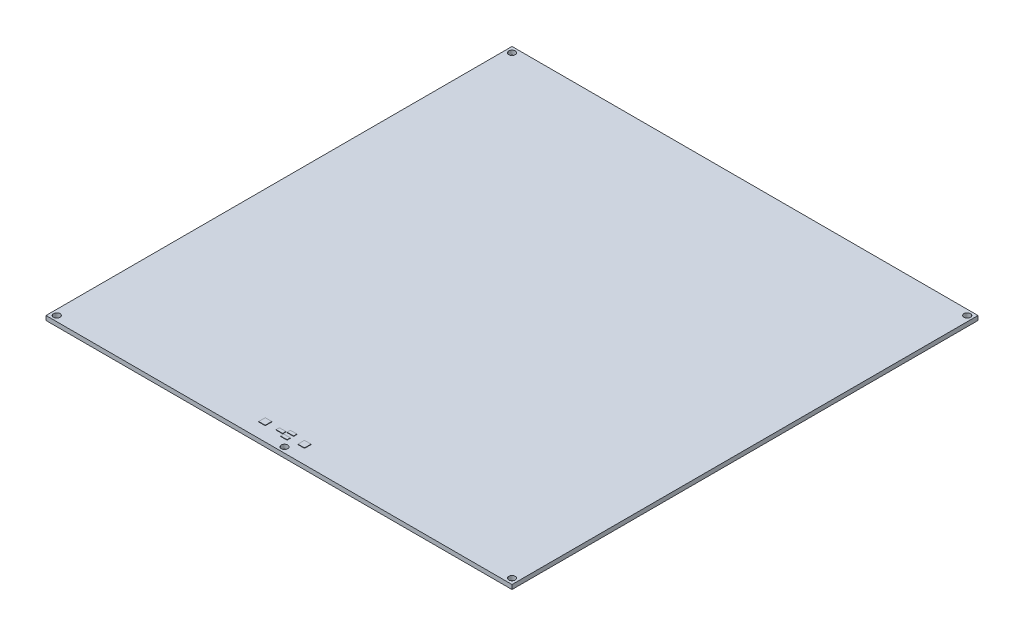
ISO-10303-21;
HEADER;
FILE_DESCRIPTION(('STEP AP214'),'2;1');
FILE_NAME('part.step','',(''),(''),'','','');
FILE_SCHEMA(('AUTOMOTIVE_DESIGN { 1 0 10303 214 1 1 1 1 }'));
ENDSEC;
DATA;
#1=APPLICATION_CONTEXT('core data for automotive mechanical design processes');
#2=APPLICATION_PROTOCOL_DEFINITION('international standard','automotive_design',2000,#1);
#3=PRODUCT_CONTEXT('',#1,'mechanical');
#4=PRODUCT('Part','Part','',(#3));
#5=PRODUCT_RELATED_PRODUCT_CATEGORY('part','',(#4));
#6=PRODUCT_DEFINITION_FORMATION('','',#4);
#7=PRODUCT_DEFINITION_CONTEXT('part definition',#1,'design');
#8=PRODUCT_DEFINITION('design','',#6,#7);
#9=PRODUCT_DEFINITION_SHAPE('','',#8);
#10=(LENGTH_UNIT() NAMED_UNIT(*) SI_UNIT(.MILLI.,.METRE.));
#11=(NAMED_UNIT(*) PLANE_ANGLE_UNIT() SI_UNIT($,.RADIAN.));
#12=(NAMED_UNIT(*) SI_UNIT($,.STERADIAN.) SOLID_ANGLE_UNIT());
#13=UNCERTAINTY_MEASURE_WITH_UNIT(LENGTH_MEASURE(1.E-05),#10,'distance_accuracy_value','');
#14=(GEOMETRIC_REPRESENTATION_CONTEXT(3) GLOBAL_UNCERTAINTY_ASSIGNED_CONTEXT((#13)) GLOBAL_UNIT_ASSIGNED_CONTEXT((#10,
#11,#12)) REPRESENTATION_CONTEXT('',''));
#15=CARTESIAN_POINT('',(0.,0.,0.));
#16=DIRECTION('',(0.,0.,1.));
#17=DIRECTION('',(1.,0.,0.));
#18=AXIS2_PLACEMENT_3D('',#15,#16,#17);
#19=CARTESIAN_POINT('',(0.,2.,0.));
#20=DIRECTION('',(0.,1.,0.));
#21=DIRECTION('',(0.,0.,1.));
#22=AXIS2_PLACEMENT_3D('',#19,#20,#21);
#23=PLANE('',#22);
#24=CARTESIAN_POINT('',(104.525132308728,2.,-104.525132308728));
#25=DIRECTION('',(0.,1.,0.));
#26=DIRECTION('',(0.,0.,1.));
#27=AXIS2_PLACEMENT_3D('',#24,#25,#26);
#28=CIRCLE('',#27,1.49999999999999);
#29=CARTESIAN_POINT('',(104.525132308728,2.,-103.025132308728));
#30=VERTEX_POINT('',#29);
#31=EDGE_CURVE('E521',#30,#30,#28,.T.);
#32=ORIENTED_EDGE('',*,*,#31,.F.);
#33=EDGE_LOOP('',(#32));
#34=FACE_BOUND('',#33,.T.);
#35=CARTESIAN_POINT('',(-104.525126265847,2.,104.525126265847));
#36=DIRECTION('',(0.,1.,0.));
#37=DIRECTION('',(0.,0.,1.));
#38=AXIS2_PLACEMENT_3D('',#35,#36,#37);
#39=CIRCLE('',#38,1.49999999999999);
#40=CARTESIAN_POINT('',(-104.525126265847,2.,106.025126265847));
#41=VERTEX_POINT('',#40);
#42=EDGE_CURVE('E523',#41,#41,#39,.T.);
#43=ORIENTED_EDGE('',*,*,#42,.F.);
#44=EDGE_LOOP('',(#43));
#45=FACE_BOUND('',#44,.T.);
#46=CARTESIAN_POINT('',(104.474867691272,2.,104.474867691272));
#47=DIRECTION('',(0.,1.,0.));
#48=DIRECTION('',(0.,0.,1.));
#49=AXIS2_PLACEMENT_3D('',#46,#47,#48);
#50=CIRCLE('',#49,1.49999999999999);
#51=CARTESIAN_POINT('',(104.474867691272,2.,105.974867691272));
#52=VERTEX_POINT('',#51);
#53=EDGE_CURVE('E531',#52,#52,#50,.T.);
#54=ORIENTED_EDGE('',*,*,#53,.F.);
#55=EDGE_LOOP('',(#54));
#56=FACE_BOUND('',#55,.T.);
#57=CARTESIAN_POINT('',(-104.474867691272,2.,-104.474867691272));
#58=DIRECTION('',(0.,1.,0.));
#59=DIRECTION('',(0.,0.,1.));
#60=AXIS2_PLACEMENT_3D('',#57,#58,#59);
#61=CIRCLE('',#60,1.49999999999999);
#62=CARTESIAN_POINT('',(-104.474867691272,2.,-102.974867691272));
#63=VERTEX_POINT('',#62);
#64=EDGE_CURVE('E537',#63,#63,#61,.T.);
#65=ORIENTED_EDGE('',*,*,#64,.F.);
#66=EDGE_LOOP('',(#65));
#67=FACE_BOUND('',#66,.T.);
#68=CARTESIAN_POINT('',(0.,2.,104.474867691272));
#69=DIRECTION('',(0.,1.,0.));
#70=DIRECTION('',(0.,0.,1.));
#71=AXIS2_PLACEMENT_3D('',#68,#69,#70);
#72=CIRCLE('',#71,1.49999999999999);
#73=CARTESIAN_POINT('',(0.,2.,105.974867691272));
#74=VERTEX_POINT('',#73);
#75=EDGE_CURVE('E543',#74,#74,#72,.T.);
#76=ORIENTED_EDGE('',*,*,#75,.F.);
#77=EDGE_LOOP('',(#76));
#78=FACE_BOUND('',#77,.T.);
#79=DIRECTION('',(-1.,0.,0.));
#80=VECTOR('',#79,1.);
#81=CARTESIAN_POINT('',(-5.04999999999998,2.,96.75));
#82=LINE('',#81,#80);
#83=CARTESIAN_POINT('',(-2.04999999999998,2.,96.75));
#84=VERTEX_POINT('',#83);
#85=CARTESIAN_POINT('',(-5.04999999999998,2.,96.75));
#86=VERTEX_POINT('',#85);
#87=EDGE_CURVE('E225',#84,#86,#82,.T.);
#88=ORIENTED_EDGE('',*,*,#87,.F.);
#89=DIRECTION('',(0.,0.,-1.));
#90=VECTOR('',#89,1.);
#91=CARTESIAN_POINT('',(-2.04999999999998,2.,96.75));
#92=LINE('',#91,#90);
#93=CARTESIAN_POINT('',(-2.04999999999998,2.,98.25));
#94=VERTEX_POINT('',#93);
#95=EDGE_CURVE('E222',#94,#84,#92,.T.);
#96=ORIENTED_EDGE('',*,*,#95,.F.);
#97=DIRECTION('',(1.,0.,0.));
#98=VECTOR('',#97,1.);
#99=CARTESIAN_POINT('',(-2.04999999999998,2.,98.25));
#100=LINE('',#99,#98);
#101=CARTESIAN_POINT('',(-5.04999999999998,2.,98.25));
#102=VERTEX_POINT('',#101);
#103=EDGE_CURVE('E234',#102,#94,#100,.T.);
#104=ORIENTED_EDGE('',*,*,#103,.F.);
#105=DIRECTION('',(0.,0.,1.));
#106=VECTOR('',#105,1.);
#107=CARTESIAN_POINT('',(-5.04999999999998,2.,98.25));
#108=LINE('',#107,#106);
#109=EDGE_CURVE('E242',#86,#102,#108,.T.);
#110=ORIENTED_EDGE('',*,*,#109,.F.);
#111=EDGE_LOOP('',(#88,#96,#104,#110));
#112=FACE_BOUND('',#111,.T.);
#113=DIRECTION('',(1.,0.,0.));
#114=VECTOR('',#113,1.);
#115=CARTESIAN_POINT('',(-12.8,2.,100.5));
#116=LINE('',#115,#114);
#117=CARTESIAN_POINT('',(-15.8,2.,100.5));
#118=VERTEX_POINT('',#117);
#119=CARTESIAN_POINT('',(-12.8,2.,100.5));
#120=VERTEX_POINT('',#119);
#121=EDGE_CURVE('E296',#118,#120,#116,.T.);
#122=ORIENTED_EDGE('',*,*,#121,.F.);
#123=DIRECTION('',(0.,0.,1.));
#124=VECTOR('',#123,1.);
#125=CARTESIAN_POINT('',(-15.8,2.,100.5));
#126=LINE('',#125,#124);
#127=CARTESIAN_POINT('',(-15.8,2.,97.5));
#128=VERTEX_POINT('',#127);
#129=EDGE_CURVE('E282',#128,#118,#126,.T.);
#130=ORIENTED_EDGE('',*,*,#129,.F.);
#131=DIRECTION('',(-1.,0.,0.));
#132=VECTOR('',#131,1.);
#133=CARTESIAN_POINT('',(-15.8,2.,97.5));
#134=LINE('',#133,#132);
#135=CARTESIAN_POINT('',(-12.8,2.,97.5));
#136=VERTEX_POINT('',#135);
#137=EDGE_CURVE('E287',#136,#128,#134,.T.);
#138=ORIENTED_EDGE('',*,*,#137,.F.);
#139=DIRECTION('',(0.,0.,-1.));
#140=VECTOR('',#139,1.);
#141=CARTESIAN_POINT('',(-12.8,2.,97.5));
#142=LINE('',#141,#140);
#143=EDGE_CURVE('E298',#120,#136,#142,.T.);
#144=ORIENTED_EDGE('',*,*,#143,.F.);
#145=EDGE_LOOP('',(#122,#130,#138,#144));
#146=FACE_BOUND('',#145,.T.);
#147=DIRECTION('',(-1.,0.,0.));
#148=VECTOR('',#147,1.);
#149=CARTESIAN_POINT('',(107.,2.,-107.));
#150=LINE('',#149,#148);
#151=CARTESIAN_POINT('',(107.,2.,-107.));
#152=VERTEX_POINT('',#151);
#153=CARTESIAN_POINT('',(-107.,2.,-107.));
#154=VERTEX_POINT('',#153);
#155=EDGE_CURVE('E340',#152,#154,#150,.T.);
#156=ORIENTED_EDGE('',*,*,#155,.T.);
#157=DIRECTION('',(0.,0.,1.));
#158=VECTOR('',#157,1.);
#159=CARTESIAN_POINT('',(-107.,2.,-107.));
#160=LINE('',#159,#158);
#161=CARTESIAN_POINT('',(-107.,2.,107.));
#162=VERTEX_POINT('',#161);
#163=EDGE_CURVE('E356',#154,#162,#160,.T.);
#164=ORIENTED_EDGE('',*,*,#163,.T.);
#165=DIRECTION('',(1.,0.,0.));
#166=VECTOR('',#165,1.);
#167=CARTESIAN_POINT('',(-107.,2.,107.));
#168=LINE('',#167,#166);
#169=CARTESIAN_POINT('',(107.,2.,107.));
#170=VERTEX_POINT('',#169);
#171=EDGE_CURVE('E359',#162,#170,#168,.T.);
#172=ORIENTED_EDGE('',*,*,#171,.T.);
#173=DIRECTION('',(0.,0.,-1.));
#174=VECTOR('',#173,1.);
#175=CARTESIAN_POINT('',(107.,2.,107.));
#176=LINE('',#175,#174);
#177=EDGE_CURVE('E345',#170,#152,#176,.T.);
#178=ORIENTED_EDGE('',*,*,#177,.T.);
#179=EDGE_LOOP('',(#156,#164,#172,#178));
#180=FACE_BOUND('',#179,.T.);
#181=DIRECTION('',(1.,0.,0.));
#182=VECTOR('',#181,1.);
#183=CARTESIAN_POINT('',(5.20000000000002,2.,100.5));
#184=LINE('',#183,#182);
#185=CARTESIAN_POINT('',(2.20000000000002,2.,100.5));
#186=VERTEX_POINT('',#185);
#187=CARTESIAN_POINT('',(5.20000000000002,2.,100.5));
#188=VERTEX_POINT('',#187);
#189=EDGE_CURVE('E325',#186,#188,#184,.T.);
#190=ORIENTED_EDGE('',*,*,#189,.F.);
#191=DIRECTION('',(0.,0.,1.));
#192=VECTOR('',#191,1.);
#193=CARTESIAN_POINT('',(2.20000000000002,2.,100.5));
#194=LINE('',#193,#192);
#195=CARTESIAN_POINT('',(2.20000000000002,2.,97.5));
#196=VERTEX_POINT('',#195);
#197=EDGE_CURVE('E311',#196,#186,#194,.T.);
#198=ORIENTED_EDGE('',*,*,#197,.F.);
#199=DIRECTION('',(-1.,0.,0.));
#200=VECTOR('',#199,1.);
#201=CARTESIAN_POINT('',(2.20000000000002,2.,97.5));
#202=LINE('',#201,#200);
#203=CARTESIAN_POINT('',(5.20000000000002,2.,97.5));
#204=VERTEX_POINT('',#203);
#205=EDGE_CURVE('E316',#204,#196,#202,.T.);
#206=ORIENTED_EDGE('',*,*,#205,.F.);
#207=DIRECTION('',(0.,0.,-1.));
#208=VECTOR('',#207,1.);
#209=CARTESIAN_POINT('',(5.20000000000002,2.,97.5));
#210=LINE('',#209,#208);
#211=EDGE_CURVE('E327',#188,#204,#210,.T.);
#212=ORIENTED_EDGE('',*,*,#211,.F.);
#213=EDGE_LOOP('',(#190,#198,#206,#212));
#214=FACE_BOUND('',#213,.T.);
#215=DIRECTION('',(0.,0.,1.));
#216=VECTOR('',#215,1.);
#217=CARTESIAN_POINT('',(-8.54999999999998,2.,99.75));
#218=LINE('',#217,#216);
#219=CARTESIAN_POINT('',(-8.54999999999998,2.,98.25));
#220=VERTEX_POINT('',#219);
#221=CARTESIAN_POINT('',(-8.54999999999998,2.,99.75));
#222=VERTEX_POINT('',#221);
#223=EDGE_CURVE('E267',#220,#222,#218,.T.);
#224=ORIENTED_EDGE('',*,*,#223,.F.);
#225=DIRECTION('',(-1.,0.,0.));
#226=VECTOR('',#225,1.);
#227=CARTESIAN_POINT('',(-8.54999999999998,2.,98.25));
#228=LINE('',#227,#226);
#229=CARTESIAN_POINT('',(-5.54999999999998,2.,98.25));
#230=VERTEX_POINT('',#229);
#231=EDGE_CURVE('E253',#230,#220,#228,.T.);
#232=ORIENTED_EDGE('',*,*,#231,.F.);
#233=DIRECTION('',(0.,0.,-1.));
#234=VECTOR('',#233,1.);
#235=CARTESIAN_POINT('',(-5.54999999999998,2.,98.25));
#236=LINE('',#235,#234);
#237=CARTESIAN_POINT('',(-5.54999999999998,2.,99.75));
#238=VERTEX_POINT('',#237);
#239=EDGE_CURVE('E258',#238,#230,#236,.T.);
#240=ORIENTED_EDGE('',*,*,#239,.F.);
#241=DIRECTION('',(1.,0.,0.));
#242=VECTOR('',#241,1.);
#243=CARTESIAN_POINT('',(-5.54999999999998,2.,99.75));
#244=LINE('',#243,#242);
#245=EDGE_CURVE('E269',#222,#238,#244,.T.);
#246=ORIENTED_EDGE('',*,*,#245,.F.);
#247=EDGE_LOOP('',(#224,#232,#240,#246));
#248=FACE_BOUND('',#247,.T.);
#249=DIRECTION('',(-1.,0.,0.));
#250=VECTOR('',#249,1.);
#251=CARTESIAN_POINT('',(-5.04999999999998,2.,99.75));
#252=LINE('',#251,#250);
#253=CARTESIAN_POINT('',(-2.04999999999998,2.,99.75));
#254=VERTEX_POINT('',#253);
#255=CARTESIAN_POINT('',(-5.04999999999998,2.,99.75));
#256=VERTEX_POINT('',#255);
#257=EDGE_CURVE('E553',#254,#256,#252,.T.);
#258=ORIENTED_EDGE('',*,*,#257,.F.);
#259=DIRECTION('',(0.,0.,-1.));
#260=VECTOR('',#259,1.);
#261=CARTESIAN_POINT('',(-2.04999999999998,2.,99.75));
#262=LINE('',#261,#260);
#263=CARTESIAN_POINT('',(-2.04999999999998,2.,101.25));
#264=VERTEX_POINT('',#263);
#265=EDGE_CURVE('E220',#264,#254,#262,.T.);
#266=ORIENTED_EDGE('',*,*,#265,.F.);
#267=DIRECTION('',(1.,0.,0.));
#268=VECTOR('',#267,1.);
#269=CARTESIAN_POINT('',(-2.04999999999998,2.,101.25));
#270=LINE('',#269,#268);
#271=CARTESIAN_POINT('',(-5.04999999999998,2.,101.25));
#272=VERTEX_POINT('',#271);
#273=EDGE_CURVE('E216',#272,#264,#270,.T.);
#274=ORIENTED_EDGE('',*,*,#273,.F.);
#275=DIRECTION('',(0.,0.,1.));
#276=VECTOR('',#275,1.);
#277=CARTESIAN_POINT('',(-5.04999999999998,2.,101.25));
#278=LINE('',#277,#276);
#279=EDGE_CURVE('E555',#256,#272,#278,.T.);
#280=ORIENTED_EDGE('',*,*,#279,.F.);
#281=EDGE_LOOP('',(#258,#266,#274,#280));
#282=FACE_BOUND('',#281,.T.);
#283=ADVANCED_FACE('F34',(#34,#45,#56,#67,#78,#112,#146,#180,#214,#248,#282),#23,.T.);
#284=CARTESIAN_POINT('',(107.,0.,-107.));
#285=DIRECTION('',(0.,0.,-1.));
#286=DIRECTION('',(-1.,0.,0.));
#287=AXIS2_PLACEMENT_3D('',#284,#285,#286);
#288=PLANE('',#287);
#289=ORIENTED_EDGE('',*,*,#155,.F.);
#290=DIRECTION('',(0.,1.,0.));
#291=VECTOR('',#290,1.);
#292=CARTESIAN_POINT('',(107.,0.,-107.));
#293=LINE('',#292,#291);
#294=CARTESIAN_POINT('',(107.,0.,-107.));
#295=VERTEX_POINT('',#294);
#296=EDGE_CURVE('E11',#295,#152,#293,.T.);
#297=ORIENTED_EDGE('',*,*,#296,.F.);
#298=DIRECTION('',(-1.,0.,0.));
#299=VECTOR('',#298,1.);
#300=CARTESIAN_POINT('',(107.,0.,-107.));
#301=LINE('',#300,#299);
#302=CARTESIAN_POINT('',(-107.,0.,-107.));
#303=VERTEX_POINT('',#302);
#304=EDGE_CURVE('E341',#295,#303,#301,.T.);
#305=ORIENTED_EDGE('',*,*,#304,.T.);
#306=DIRECTION('',(0.,1.,0.));
#307=VECTOR('',#306,1.);
#308=CARTESIAN_POINT('',(-107.,0.,-107.));
#309=LINE('',#308,#307);
#310=EDGE_CURVE('E38',#303,#154,#309,.T.);
#311=ORIENTED_EDGE('',*,*,#310,.T.);
#312=EDGE_LOOP('',(#289,#297,#305,#311));
#313=FACE_BOUND('',#312,.T.);
#314=ADVANCED_FACE('F36',(#313),#288,.T.);
#315=CARTESIAN_POINT('',(107.,0.,107.));
#316=DIRECTION('',(1.,0.,0.));
#317=DIRECTION('',(0.,0.,-1.));
#318=AXIS2_PLACEMENT_3D('',#315,#316,#317);
#319=PLANE('',#318);
#320=ORIENTED_EDGE('',*,*,#177,.F.);
#321=DIRECTION('',(0.,1.,0.));
#322=VECTOR('',#321,1.);
#323=CARTESIAN_POINT('',(107.,0.,107.));
#324=LINE('',#323,#322);
#325=CARTESIAN_POINT('',(107.,0.,107.));
#326=VERTEX_POINT('',#325);
#327=EDGE_CURVE('E43',#326,#170,#324,.T.);
#328=ORIENTED_EDGE('',*,*,#327,.F.);
#329=DIRECTION('',(0.,0.,-1.));
#330=VECTOR('',#329,1.);
#331=CARTESIAN_POINT('',(107.,0.,107.));
#332=LINE('',#331,#330);
#333=EDGE_CURVE('E351',#326,#295,#332,.T.);
#334=ORIENTED_EDGE('',*,*,#333,.T.);
#335=ORIENTED_EDGE('',*,*,#296,.T.);
#336=EDGE_LOOP('',(#320,#328,#334,#335));
#337=FACE_BOUND('',#336,.T.);
#338=ADVANCED_FACE('F377',(#337),#319,.T.);
#339=CARTESIAN_POINT('',(-107.,0.,107.));
#340=DIRECTION('',(0.,0.,1.));
#341=DIRECTION('',(1.,0.,0.));
#342=AXIS2_PLACEMENT_3D('',#339,#340,#341);
#343=PLANE('',#342);
#344=ORIENTED_EDGE('',*,*,#171,.F.);
#345=DIRECTION('',(0.,1.,0.));
#346=VECTOR('',#345,1.);
#347=CARTESIAN_POINT('',(-107.,0.,107.));
#348=LINE('',#347,#346);
#349=CARTESIAN_POINT('',(-107.,0.,107.));
#350=VERTEX_POINT('',#349);
#351=EDGE_CURVE('E364',#350,#162,#348,.T.);
#352=ORIENTED_EDGE('',*,*,#351,.F.);
#353=DIRECTION('',(1.,0.,0.));
#354=VECTOR('',#353,1.);
#355=CARTESIAN_POINT('',(-107.,0.,107.));
#356=LINE('',#355,#354);
#357=EDGE_CURVE('E348',#350,#326,#356,.T.);
#358=ORIENTED_EDGE('',*,*,#357,.T.);
#359=ORIENTED_EDGE('',*,*,#327,.T.);
#360=EDGE_LOOP('',(#344,#352,#358,#359));
#361=FACE_BOUND('',#360,.T.);
#362=ADVANCED_FACE('F383',(#361),#343,.T.);
#363=CARTESIAN_POINT('',(-107.,0.,-107.));
#364=DIRECTION('',(-1.,0.,0.));
#365=DIRECTION('',(0.,0.,1.));
#366=AXIS2_PLACEMENT_3D('',#363,#364,#365);
#367=PLANE('',#366);
#368=ORIENTED_EDGE('',*,*,#163,.F.);
#369=ORIENTED_EDGE('',*,*,#310,.F.);
#370=DIRECTION('',(0.,0.,1.));
#371=VECTOR('',#370,1.);
#372=CARTESIAN_POINT('',(-107.,0.,-107.));
#373=LINE('',#372,#371);
#374=EDGE_CURVE('E344',#303,#350,#373,.T.);
#375=ORIENTED_EDGE('',*,*,#374,.T.);
#376=ORIENTED_EDGE('',*,*,#351,.T.);
#377=EDGE_LOOP('',(#368,#369,#375,#376));
#378=FACE_BOUND('',#377,.T.);
#379=ADVANCED_FACE('F372',(#378),#367,.T.);
#380=CARTESIAN_POINT('',(0.,0.,0.));
#381=DIRECTION('',(0.,1.,0.));
#382=DIRECTION('',(0.,0.,1.));
#383=AXIS2_PLACEMENT_3D('',#380,#381,#382);
#384=PLANE('',#383);
#385=CARTESIAN_POINT('',(104.525132308728,0.,-104.525132308728));
#386=DIRECTION('',(0.,1.,0.));
#387=DIRECTION('',(0.,0.,1.));
#388=AXIS2_PLACEMENT_3D('',#385,#386,#387);
#389=CIRCLE('',#388,1.49999999999999);
#390=CARTESIAN_POINT('',(104.525132308728,0.,-103.025132308728));
#391=VERTEX_POINT('',#390);
#392=EDGE_CURVE('E519',#391,#391,#389,.T.);
#393=ORIENTED_EDGE('',*,*,#392,.T.);
#394=EDGE_LOOP('',(#393));
#395=FACE_BOUND('',#394,.T.);
#396=CARTESIAN_POINT('',(-104.525126265847,0.,104.525126265847));
#397=DIRECTION('',(0.,1.,0.));
#398=DIRECTION('',(0.,0.,1.));
#399=AXIS2_PLACEMENT_3D('',#396,#397,#398);
#400=CIRCLE('',#399,1.49999999999999);
#401=CARTESIAN_POINT('',(-104.525126265847,0.,106.025126265847));
#402=VERTEX_POINT('',#401);
#403=EDGE_CURVE('E528',#402,#402,#400,.T.);
#404=ORIENTED_EDGE('',*,*,#403,.T.);
#405=EDGE_LOOP('',(#404));
#406=FACE_BOUND('',#405,.T.);
#407=CARTESIAN_POINT('',(104.474867691272,0.,104.474867691272));
#408=DIRECTION('',(0.,1.,0.));
#409=DIRECTION('',(0.,0.,1.));
#410=AXIS2_PLACEMENT_3D('',#407,#408,#409);
#411=CIRCLE('',#410,1.49999999999999);
#412=CARTESIAN_POINT('',(104.474867691272,0.,105.974867691272));
#413=VERTEX_POINT('',#412);
#414=EDGE_CURVE('E534',#413,#413,#411,.T.);
#415=ORIENTED_EDGE('',*,*,#414,.T.);
#416=EDGE_LOOP('',(#415));
#417=FACE_BOUND('',#416,.T.);
#418=CARTESIAN_POINT('',(-104.474867691272,0.,-104.474867691272));
#419=DIRECTION('',(0.,1.,0.));
#420=DIRECTION('',(0.,0.,1.));
#421=AXIS2_PLACEMENT_3D('',#418,#419,#420);
#422=CIRCLE('',#421,1.49999999999999);
#423=CARTESIAN_POINT('',(-104.474867691272,0.,-102.974867691272));
#424=VERTEX_POINT('',#423);
#425=EDGE_CURVE('E540',#424,#424,#422,.T.);
#426=ORIENTED_EDGE('',*,*,#425,.T.);
#427=EDGE_LOOP('',(#426));
#428=FACE_BOUND('',#427,.T.);
#429=CARTESIAN_POINT('',(0.,0.,104.474867691272));
#430=DIRECTION('',(0.,1.,0.));
#431=DIRECTION('',(0.,0.,1.));
#432=AXIS2_PLACEMENT_3D('',#429,#430,#431);
#433=CIRCLE('',#432,1.49999999999999);
#434=CARTESIAN_POINT('',(0.,0.,105.974867691272));
#435=VERTEX_POINT('',#434);
#436=EDGE_CURVE('E546',#435,#435,#433,.T.);
#437=ORIENTED_EDGE('',*,*,#436,.T.);
#438=EDGE_LOOP('',(#437));
#439=FACE_BOUND('',#438,.T.);
#440=ORIENTED_EDGE('',*,*,#304,.F.);
#441=ORIENTED_EDGE('',*,*,#333,.F.);
#442=ORIENTED_EDGE('',*,*,#357,.F.);
#443=ORIENTED_EDGE('',*,*,#374,.F.);
#444=EDGE_LOOP('',(#440,#441,#442,#443));
#445=FACE_BOUND('',#444,.T.);
#446=ADVANCED_FACE('F380',(#395,#406,#417,#428,#439,#445),#384,.F.);
#447=CARTESIAN_POINT('',(2.20000000000002,2.2,100.5));
#448=DIRECTION('',(1.,0.,0.));
#449=DIRECTION('',(0.,0.,-1.));
#450=AXIS2_PLACEMENT_3D('',#447,#448,#449);
#451=PLANE('',#450);
#452=ORIENTED_EDGE('',*,*,#197,.T.);
#453=DIRECTION('',(0.,-1.,0.));
#454=VECTOR('',#453,1.);
#455=CARTESIAN_POINT('',(2.20000000000002,2.2,100.5));
#456=LINE('',#455,#454);
#457=CARTESIAN_POINT('',(2.20000000000002,2.2,100.5));
#458=VERTEX_POINT('',#457);
#459=EDGE_CURVE('E338',#458,#186,#456,.T.);
#460=ORIENTED_EDGE('',*,*,#459,.F.);
#461=DIRECTION('',(0.,0.,1.));
#462=VECTOR('',#461,1.);
#463=CARTESIAN_POINT('',(2.20000000000002,2.2,100.5));
#464=LINE('',#463,#462);
#465=CARTESIAN_POINT('',(2.20000000000002,2.2,97.5));
#466=VERTEX_POINT('',#465);
#467=EDGE_CURVE('E312',#466,#458,#464,.T.);
#468=ORIENTED_EDGE('',*,*,#467,.F.);
#469=DIRECTION('',(0.,-1.,0.));
#470=VECTOR('',#469,1.);
#471=CARTESIAN_POINT('',(2.20000000000002,2.2,97.5));
#472=LINE('',#471,#470);
#473=EDGE_CURVE('E322',#466,#196,#472,.T.);
#474=ORIENTED_EDGE('',*,*,#473,.T.);
#475=EDGE_LOOP('',(#452,#460,#468,#474));
#476=FACE_BOUND('',#475,.T.);
#477=ADVANCED_FACE('F402',(#476),#451,.F.);
#478=CARTESIAN_POINT('',(5.20000000000002,2.2,100.5));
#479=DIRECTION('',(0.,0.,-1.));
#480=DIRECTION('',(-1.,0.,0.));
#481=AXIS2_PLACEMENT_3D('',#478,#479,#480);
#482=PLANE('',#481);
#483=ORIENTED_EDGE('',*,*,#189,.T.);
#484=DIRECTION('',(0.,-1.,0.));
#485=VECTOR('',#484,1.);
#486=CARTESIAN_POINT('',(5.20000000000002,2.2,100.5));
#487=LINE('',#486,#485);
#488=CARTESIAN_POINT('',(5.20000000000002,2.2,100.5));
#489=VERTEX_POINT('',#488);
#490=EDGE_CURVE('E335',#489,#188,#487,.T.);
#491=ORIENTED_EDGE('',*,*,#490,.F.);
#492=DIRECTION('',(1.,0.,0.));
#493=VECTOR('',#492,1.);
#494=CARTESIAN_POINT('',(5.20000000000002,2.2,100.5));
#495=LINE('',#494,#493);
#496=EDGE_CURVE('E315',#458,#489,#495,.T.);
#497=ORIENTED_EDGE('',*,*,#496,.F.);
#498=ORIENTED_EDGE('',*,*,#459,.T.);
#499=EDGE_LOOP('',(#483,#491,#497,#498));
#500=FACE_BOUND('',#499,.T.);
#501=ADVANCED_FACE('F406',(#500),#482,.F.);
#502=CARTESIAN_POINT('',(5.20000000000002,2.2,97.5));
#503=DIRECTION('',(-1.,0.,0.));
#504=DIRECTION('',(0.,0.,1.));
#505=AXIS2_PLACEMENT_3D('',#502,#503,#504);
#506=PLANE('',#505);
#507=ORIENTED_EDGE('',*,*,#211,.T.);
#508=DIRECTION('',(0.,-1.,0.));
#509=VECTOR('',#508,1.);
#510=CARTESIAN_POINT('',(5.20000000000002,2.2,97.5));
#511=LINE('',#510,#509);
#512=CARTESIAN_POINT('',(5.20000000000002,2.2,97.5));
#513=VERTEX_POINT('',#512);
#514=EDGE_CURVE('E333',#513,#204,#511,.T.);
#515=ORIENTED_EDGE('',*,*,#514,.F.);
#516=DIRECTION('',(0.,0.,-1.));
#517=VECTOR('',#516,1.);
#518=CARTESIAN_POINT('',(5.20000000000002,2.2,97.5));
#519=LINE('',#518,#517);
#520=EDGE_CURVE('E318',#489,#513,#519,.T.);
#521=ORIENTED_EDGE('',*,*,#520,.F.);
#522=ORIENTED_EDGE('',*,*,#490,.T.);
#523=EDGE_LOOP('',(#507,#515,#521,#522));
#524=FACE_BOUND('',#523,.T.);
#525=ADVANCED_FACE('F410',(#524),#506,.F.);
#526=CARTESIAN_POINT('',(2.20000000000002,2.2,97.5));
#527=DIRECTION('',(0.,0.,1.));
#528=DIRECTION('',(1.,0.,0.));
#529=AXIS2_PLACEMENT_3D('',#526,#527,#528);
#530=PLANE('',#529);
#531=ORIENTED_EDGE('',*,*,#205,.T.);
#532=ORIENTED_EDGE('',*,*,#473,.F.);
#533=DIRECTION('',(-1.,0.,0.));
#534=VECTOR('',#533,1.);
#535=CARTESIAN_POINT('',(2.20000000000002,2.2,97.5));
#536=LINE('',#535,#534);
#537=EDGE_CURVE('E320',#513,#466,#536,.T.);
#538=ORIENTED_EDGE('',*,*,#537,.F.);
#539=ORIENTED_EDGE('',*,*,#514,.T.);
#540=EDGE_LOOP('',(#531,#532,#538,#539));
#541=FACE_BOUND('',#540,.T.);
#542=ADVANCED_FACE('F414',(#541),#530,.F.);
#543=CARTESIAN_POINT('',(0.,2.2,0.));
#544=DIRECTION('',(0.,-1.,0.));
#545=DIRECTION('',(0.,0.,-1.));
#546=AXIS2_PLACEMENT_3D('',#543,#544,#545);
#547=PLANE('',#546);
#548=ORIENTED_EDGE('',*,*,#467,.T.);
#549=ORIENTED_EDGE('',*,*,#496,.T.);
#550=ORIENTED_EDGE('',*,*,#520,.T.);
#551=ORIENTED_EDGE('',*,*,#537,.T.);
#552=EDGE_LOOP('',(#548,#549,#550,#551));
#553=FACE_BOUND('',#552,.T.);
#554=ADVANCED_FACE('F418',(#553),#547,.F.);
#555=CARTESIAN_POINT('',(-15.8,2.2,100.5));
#556=DIRECTION('',(1.,0.,0.));
#557=DIRECTION('',(0.,0.,-1.));
#558=AXIS2_PLACEMENT_3D('',#555,#556,#557);
#559=PLANE('',#558);
#560=ORIENTED_EDGE('',*,*,#129,.T.);
#561=DIRECTION('',(0.,-1.,0.));
#562=VECTOR('',#561,1.);
#563=CARTESIAN_POINT('',(-15.8,2.2,100.5));
#564=LINE('',#563,#562);
#565=CARTESIAN_POINT('',(-15.8,2.2,100.5));
#566=VERTEX_POINT('',#565);
#567=EDGE_CURVE('E309',#566,#118,#564,.T.);
#568=ORIENTED_EDGE('',*,*,#567,.F.);
#569=DIRECTION('',(0.,0.,1.));
#570=VECTOR('',#569,1.);
#571=CARTESIAN_POINT('',(-15.8,2.2,100.5));
#572=LINE('',#571,#570);
#573=CARTESIAN_POINT('',(-15.8,2.2,97.5));
#574=VERTEX_POINT('',#573);
#575=EDGE_CURVE('E283',#574,#566,#572,.T.);
#576=ORIENTED_EDGE('',*,*,#575,.F.);
#577=DIRECTION('',(0.,-1.,0.));
#578=VECTOR('',#577,1.);
#579=CARTESIAN_POINT('',(-15.8,2.2,97.5));
#580=LINE('',#579,#578);
#581=EDGE_CURVE('E293',#574,#128,#580,.T.);
#582=ORIENTED_EDGE('',*,*,#581,.T.);
#583=EDGE_LOOP('',(#560,#568,#576,#582));
#584=FACE_BOUND('',#583,.T.);
#585=ADVANCED_FACE('F422',(#584),#559,.F.);
#586=CARTESIAN_POINT('',(-12.8,2.2,100.5));
#587=DIRECTION('',(0.,0.,-1.));
#588=DIRECTION('',(-1.,0.,0.));
#589=AXIS2_PLACEMENT_3D('',#586,#587,#588);
#590=PLANE('',#589);
#591=ORIENTED_EDGE('',*,*,#121,.T.);
#592=DIRECTION('',(0.,-1.,0.));
#593=VECTOR('',#592,1.);
#594=CARTESIAN_POINT('',(-12.8,2.2,100.5));
#595=LINE('',#594,#593);
#596=CARTESIAN_POINT('',(-12.8,2.2,100.5));
#597=VERTEX_POINT('',#596);
#598=EDGE_CURVE('E306',#597,#120,#595,.T.);
#599=ORIENTED_EDGE('',*,*,#598,.F.);
#600=DIRECTION('',(1.,0.,0.));
#601=VECTOR('',#600,1.);
#602=CARTESIAN_POINT('',(-12.8,2.2,100.5));
#603=LINE('',#602,#601);
#604=EDGE_CURVE('E286',#566,#597,#603,.T.);
#605=ORIENTED_EDGE('',*,*,#604,.F.);
#606=ORIENTED_EDGE('',*,*,#567,.T.);
#607=EDGE_LOOP('',(#591,#599,#605,#606));
#608=FACE_BOUND('',#607,.T.);
#609=ADVANCED_FACE('F426',(#608),#590,.F.);
#610=CARTESIAN_POINT('',(-12.8,2.2,97.5));
#611=DIRECTION('',(-1.,0.,0.));
#612=DIRECTION('',(0.,0.,1.));
#613=AXIS2_PLACEMENT_3D('',#610,#611,#612);
#614=PLANE('',#613);
#615=ORIENTED_EDGE('',*,*,#143,.T.);
#616=DIRECTION('',(0.,-1.,0.));
#617=VECTOR('',#616,1.);
#618=CARTESIAN_POINT('',(-12.8,2.2,97.5));
#619=LINE('',#618,#617);
#620=CARTESIAN_POINT('',(-12.8,2.2,97.5));
#621=VERTEX_POINT('',#620);
#622=EDGE_CURVE('E304',#621,#136,#619,.T.);
#623=ORIENTED_EDGE('',*,*,#622,.F.);
#624=DIRECTION('',(0.,0.,-1.));
#625=VECTOR('',#624,1.);
#626=CARTESIAN_POINT('',(-12.8,2.2,97.5));
#627=LINE('',#626,#625);
#628=EDGE_CURVE('E289',#597,#621,#627,.T.);
#629=ORIENTED_EDGE('',*,*,#628,.F.);
#630=ORIENTED_EDGE('',*,*,#598,.T.);
#631=EDGE_LOOP('',(#615,#623,#629,#630));
#632=FACE_BOUND('',#631,.T.);
#633=ADVANCED_FACE('F430',(#632),#614,.F.);
#634=CARTESIAN_POINT('',(-15.8,2.2,97.5));
#635=DIRECTION('',(0.,0.,1.));
#636=DIRECTION('',(1.,0.,0.));
#637=AXIS2_PLACEMENT_3D('',#634,#635,#636);
#638=PLANE('',#637);
#639=ORIENTED_EDGE('',*,*,#137,.T.);
#640=ORIENTED_EDGE('',*,*,#581,.F.);
#641=DIRECTION('',(-1.,0.,0.));
#642=VECTOR('',#641,1.);
#643=CARTESIAN_POINT('',(-15.8,2.2,97.5));
#644=LINE('',#643,#642);
#645=EDGE_CURVE('E291',#621,#574,#644,.T.);
#646=ORIENTED_EDGE('',*,*,#645,.F.);
#647=ORIENTED_EDGE('',*,*,#622,.T.);
#648=EDGE_LOOP('',(#639,#640,#646,#647));
#649=FACE_BOUND('',#648,.T.);
#650=ADVANCED_FACE('F434',(#649),#638,.F.);
#651=CARTESIAN_POINT('',(0.,2.2,0.));
#652=DIRECTION('',(0.,-1.,0.));
#653=DIRECTION('',(0.,0.,-1.));
#654=AXIS2_PLACEMENT_3D('',#651,#652,#653);
#655=PLANE('',#654);
#656=ORIENTED_EDGE('',*,*,#575,.T.);
#657=ORIENTED_EDGE('',*,*,#604,.T.);
#658=ORIENTED_EDGE('',*,*,#628,.T.);
#659=ORIENTED_EDGE('',*,*,#645,.T.);
#660=EDGE_LOOP('',(#656,#657,#658,#659));
#661=FACE_BOUND('',#660,.T.);
#662=ADVANCED_FACE('F438',(#661),#655,.F.);
#663=CARTESIAN_POINT('',(-8.54999999999998,2.2,98.25));
#664=DIRECTION('',(0.,0.,1.));
#665=DIRECTION('',(1.,0.,0.));
#666=AXIS2_PLACEMENT_3D('',#663,#664,#665);
#667=PLANE('',#666);
#668=ORIENTED_EDGE('',*,*,#231,.T.);
#669=DIRECTION('',(0.,-1.,0.));
#670=VECTOR('',#669,1.);
#671=CARTESIAN_POINT('',(-8.54999999999998,2.2,98.25));
#672=LINE('',#671,#670);
#673=CARTESIAN_POINT('',(-8.54999999999998,2.2,98.25));
#674=VERTEX_POINT('',#673);
#675=EDGE_CURVE('E280',#674,#220,#672,.T.);
#676=ORIENTED_EDGE('',*,*,#675,.F.);
#677=DIRECTION('',(-1.,0.,0.));
#678=VECTOR('',#677,1.);
#679=CARTESIAN_POINT('',(-8.54999999999998,2.2,98.25));
#680=LINE('',#679,#678);
#681=CARTESIAN_POINT('',(-5.54999999999998,2.2,98.25));
#682=VERTEX_POINT('',#681);
#683=EDGE_CURVE('E254',#682,#674,#680,.T.);
#684=ORIENTED_EDGE('',*,*,#683,.F.);
#685=DIRECTION('',(0.,-1.,0.));
#686=VECTOR('',#685,1.);
#687=CARTESIAN_POINT('',(-5.54999999999998,2.2,98.25));
#688=LINE('',#687,#686);
#689=EDGE_CURVE('E264',#682,#230,#688,.T.);
#690=ORIENTED_EDGE('',*,*,#689,.T.);
#691=EDGE_LOOP('',(#668,#676,#684,#690));
#692=FACE_BOUND('',#691,.T.);
#693=ADVANCED_FACE('F442',(#692),#667,.F.);
#694=CARTESIAN_POINT('',(-8.54999999999998,2.2,99.75));
#695=DIRECTION('',(1.,0.,0.));
#696=DIRECTION('',(0.,0.,-1.));
#697=AXIS2_PLACEMENT_3D('',#694,#695,#696);
#698=PLANE('',#697);
#699=ORIENTED_EDGE('',*,*,#223,.T.);
#700=DIRECTION('',(0.,-1.,0.));
#701=VECTOR('',#700,1.);
#702=CARTESIAN_POINT('',(-8.54999999999998,2.2,99.75));
#703=LINE('',#702,#701);
#704=CARTESIAN_POINT('',(-8.54999999999998,2.2,99.75));
#705=VERTEX_POINT('',#704);
#706=EDGE_CURVE('E277',#705,#222,#703,.T.);
#707=ORIENTED_EDGE('',*,*,#706,.F.);
#708=DIRECTION('',(0.,0.,1.));
#709=VECTOR('',#708,1.);
#710=CARTESIAN_POINT('',(-8.54999999999998,2.2,99.75));
#711=LINE('',#710,#709);
#712=EDGE_CURVE('E257',#674,#705,#711,.T.);
#713=ORIENTED_EDGE('',*,*,#712,.F.);
#714=ORIENTED_EDGE('',*,*,#675,.T.);
#715=EDGE_LOOP('',(#699,#707,#713,#714));
#716=FACE_BOUND('',#715,.T.);
#717=ADVANCED_FACE('F446',(#716),#698,.F.);
#718=CARTESIAN_POINT('',(-5.54999999999998,2.2,99.75));
#719=DIRECTION('',(0.,0.,-1.));
#720=DIRECTION('',(-1.,0.,0.));
#721=AXIS2_PLACEMENT_3D('',#718,#719,#720);
#722=PLANE('',#721);
#723=ORIENTED_EDGE('',*,*,#245,.T.);
#724=DIRECTION('',(0.,-1.,0.));
#725=VECTOR('',#724,1.);
#726=CARTESIAN_POINT('',(-5.54999999999998,2.2,99.75));
#727=LINE('',#726,#725);
#728=CARTESIAN_POINT('',(-5.54999999999998,2.2,99.75));
#729=VERTEX_POINT('',#728);
#730=EDGE_CURVE('E275',#729,#238,#727,.T.);
#731=ORIENTED_EDGE('',*,*,#730,.F.);
#732=DIRECTION('',(1.,0.,0.));
#733=VECTOR('',#732,1.);
#734=CARTESIAN_POINT('',(-5.54999999999998,2.2,99.75));
#735=LINE('',#734,#733);
#736=EDGE_CURVE('E260',#705,#729,#735,.T.);
#737=ORIENTED_EDGE('',*,*,#736,.F.);
#738=ORIENTED_EDGE('',*,*,#706,.T.);
#739=EDGE_LOOP('',(#723,#731,#737,#738));
#740=FACE_BOUND('',#739,.T.);
#741=ADVANCED_FACE('F450',(#740),#722,.F.);
#742=CARTESIAN_POINT('',(-5.54999999999998,2.2,98.25));
#743=DIRECTION('',(-1.,0.,0.));
#744=DIRECTION('',(0.,0.,1.));
#745=AXIS2_PLACEMENT_3D('',#742,#743,#744);
#746=PLANE('',#745);
#747=ORIENTED_EDGE('',*,*,#239,.T.);
#748=ORIENTED_EDGE('',*,*,#689,.F.);
#749=DIRECTION('',(0.,0.,-1.));
#750=VECTOR('',#749,1.);
#751=CARTESIAN_POINT('',(-5.54999999999998,2.2,98.25));
#752=LINE('',#751,#750);
#753=EDGE_CURVE('E262',#729,#682,#752,.T.);
#754=ORIENTED_EDGE('',*,*,#753,.F.);
#755=ORIENTED_EDGE('',*,*,#730,.T.);
#756=EDGE_LOOP('',(#747,#748,#754,#755));
#757=FACE_BOUND('',#756,.T.);
#758=ADVANCED_FACE('F454',(#757),#746,.F.);
#759=CARTESIAN_POINT('',(0.,2.2,0.));
#760=DIRECTION('',(0.,-1.,0.));
#761=DIRECTION('',(0.,0.,-1.));
#762=AXIS2_PLACEMENT_3D('',#759,#760,#761);
#763=PLANE('',#762);
#764=ORIENTED_EDGE('',*,*,#683,.T.);
#765=ORIENTED_EDGE('',*,*,#712,.T.);
#766=ORIENTED_EDGE('',*,*,#736,.T.);
#767=ORIENTED_EDGE('',*,*,#753,.T.);
#768=EDGE_LOOP('',(#764,#765,#766,#767));
#769=FACE_BOUND('',#768,.T.);
#770=ADVANCED_FACE('F458',(#769),#763,.F.);
#771=CARTESIAN_POINT('',(-2.04999999999998,2.2,96.75));
#772=DIRECTION('',(-1.,0.,0.));
#773=DIRECTION('',(0.,0.,1.));
#774=AXIS2_PLACEMENT_3D('',#771,#772,#773);
#775=PLANE('',#774);
#776=ORIENTED_EDGE('',*,*,#95,.T.);
#777=DIRECTION('',(0.,-1.,0.));
#778=VECTOR('',#777,1.);
#779=CARTESIAN_POINT('',(-2.04999999999998,2.2,96.75));
#780=LINE('',#779,#778);
#781=CARTESIAN_POINT('',(-2.04999999999998,2.2,96.75));
#782=VERTEX_POINT('',#781);
#783=EDGE_CURVE('E251',#782,#84,#780,.T.);
#784=ORIENTED_EDGE('',*,*,#783,.F.);
#785=DIRECTION('',(0.,0.,-1.));
#786=VECTOR('',#785,1.);
#787=CARTESIAN_POINT('',(-2.04999999999998,2.2,96.75));
#788=LINE('',#787,#786);
#789=CARTESIAN_POINT('',(-2.04999999999998,2.2,98.25));
#790=VERTEX_POINT('',#789);
#791=EDGE_CURVE('E230',#790,#782,#788,.T.);
#792=ORIENTED_EDGE('',*,*,#791,.F.);
#793=DIRECTION('',(0.,-1.,0.));
#794=VECTOR('',#793,1.);
#795=CARTESIAN_POINT('',(-2.04999999999998,2.2,98.25));
#796=LINE('',#795,#794);
#797=EDGE_CURVE('E239',#790,#94,#796,.T.);
#798=ORIENTED_EDGE('',*,*,#797,.T.);
#799=EDGE_LOOP('',(#776,#784,#792,#798));
#800=FACE_BOUND('',#799,.T.);
#801=ADVANCED_FACE('F462',(#800),#775,.F.);
#802=CARTESIAN_POINT('',(-5.04999999999998,2.2,96.75));
#803=DIRECTION('',(0.,0.,1.));
#804=DIRECTION('',(1.,0.,0.));
#805=AXIS2_PLACEMENT_3D('',#802,#803,#804);
#806=PLANE('',#805);
#807=ORIENTED_EDGE('',*,*,#87,.T.);
#808=DIRECTION('',(0.,-1.,0.));
#809=VECTOR('',#808,1.);
#810=CARTESIAN_POINT('',(-5.04999999999998,2.2,96.75));
#811=LINE('',#810,#809);
#812=CARTESIAN_POINT('',(-5.04999999999998,2.2,96.75));
#813=VERTEX_POINT('',#812);
#814=EDGE_CURVE('E248',#813,#86,#811,.T.);
#815=ORIENTED_EDGE('',*,*,#814,.F.);
#816=DIRECTION('',(-1.,0.,0.));
#817=VECTOR('',#816,1.);
#818=CARTESIAN_POINT('',(-5.04999999999998,2.2,96.75));
#819=LINE('',#818,#817);
#820=EDGE_CURVE('E233',#782,#813,#819,.T.);
#821=ORIENTED_EDGE('',*,*,#820,.F.);
#822=ORIENTED_EDGE('',*,*,#783,.T.);
#823=EDGE_LOOP('',(#807,#815,#821,#822));
#824=FACE_BOUND('',#823,.T.);
#825=ADVANCED_FACE('F466',(#824),#806,.F.);
#826=CARTESIAN_POINT('',(-5.04999999999998,2.2,98.25));
#827=DIRECTION('',(1.,0.,0.));
#828=DIRECTION('',(0.,0.,-1.));
#829=AXIS2_PLACEMENT_3D('',#826,#827,#828);
#830=PLANE('',#829);
#831=ORIENTED_EDGE('',*,*,#109,.T.);
#832=DIRECTION('',(0.,-1.,0.));
#833=VECTOR('',#832,1.);
#834=CARTESIAN_POINT('',(-5.04999999999998,2.2,98.25));
#835=LINE('',#834,#833);
#836=CARTESIAN_POINT('',(-5.04999999999998,2.2,98.25));
#837=VERTEX_POINT('',#836);
#838=EDGE_CURVE('E59',#837,#102,#835,.T.);
#839=ORIENTED_EDGE('',*,*,#838,.F.);
#840=DIRECTION('',(0.,0.,1.));
#841=VECTOR('',#840,1.);
#842=CARTESIAN_POINT('',(-5.04999999999998,2.2,98.25));
#843=LINE('',#842,#841);
#844=EDGE_CURVE('E236',#813,#837,#843,.T.);
#845=ORIENTED_EDGE('',*,*,#844,.F.);
#846=ORIENTED_EDGE('',*,*,#814,.T.);
#847=EDGE_LOOP('',(#831,#839,#845,#846));
#848=FACE_BOUND('',#847,.T.);
#849=ADVANCED_FACE('F470',(#848),#830,.F.);
#850=CARTESIAN_POINT('',(-2.04999999999998,2.2,98.25));
#851=DIRECTION('',(0.,0.,-1.));
#852=DIRECTION('',(-1.,0.,0.));
#853=AXIS2_PLACEMENT_3D('',#850,#851,#852);
#854=PLANE('',#853);
#855=ORIENTED_EDGE('',*,*,#103,.T.);
#856=ORIENTED_EDGE('',*,*,#797,.F.);
#857=DIRECTION('',(1.,0.,0.));
#858=VECTOR('',#857,1.);
#859=CARTESIAN_POINT('',(-2.04999999999998,2.2,98.25));
#860=LINE('',#859,#858);
#861=EDGE_CURVE('E238',#837,#790,#860,.T.);
#862=ORIENTED_EDGE('',*,*,#861,.F.);
#863=ORIENTED_EDGE('',*,*,#838,.T.);
#864=EDGE_LOOP('',(#855,#856,#862,#863));
#865=FACE_BOUND('',#864,.T.);
#866=ADVANCED_FACE('F474',(#865),#854,.F.);
#867=CARTESIAN_POINT('',(0.,2.2,0.));
#868=DIRECTION('',(0.,-1.,0.));
#869=DIRECTION('',(0.,0.,-1.));
#870=AXIS2_PLACEMENT_3D('',#867,#868,#869);
#871=PLANE('',#870);
#872=ORIENTED_EDGE('',*,*,#791,.T.);
#873=ORIENTED_EDGE('',*,*,#820,.T.);
#874=ORIENTED_EDGE('',*,*,#844,.T.);
#875=ORIENTED_EDGE('',*,*,#861,.T.);
#876=EDGE_LOOP('',(#872,#873,#874,#875));
#877=FACE_BOUND('',#876,.T.);
#878=ADVANCED_FACE('F478',(#877),#871,.F.);
#879=CARTESIAN_POINT('',(-2.04999999999998,2.2,99.75));
#880=DIRECTION('',(-1.,0.,0.));
#881=DIRECTION('',(0.,0.,1.));
#882=AXIS2_PLACEMENT_3D('',#879,#880,#881);
#883=PLANE('',#882);
#884=ORIENTED_EDGE('',*,*,#265,.T.);
#885=DIRECTION('',(0.,-1.,0.));
#886=VECTOR('',#885,1.);
#887=CARTESIAN_POINT('',(-2.04999999999998,2.2,99.75));
#888=LINE('',#887,#886);
#889=CARTESIAN_POINT('',(-2.04999999999998,2.2,99.75));
#890=VERTEX_POINT('',#889);
#891=EDGE_CURVE('E201',#890,#254,#888,.T.);
#892=ORIENTED_EDGE('',*,*,#891,.F.);
#893=DIRECTION('',(0.,0.,-1.));
#894=VECTOR('',#893,1.);
#895=CARTESIAN_POINT('',(-2.04999999999998,2.2,99.75));
#896=LINE('',#895,#894);
#897=CARTESIAN_POINT('',(-2.04999999999998,2.2,101.25));
#898=VERTEX_POINT('',#897);
#899=EDGE_CURVE('E208',#898,#890,#896,.T.);
#900=ORIENTED_EDGE('',*,*,#899,.F.);
#901=DIRECTION('',(0.,-1.,0.));
#902=VECTOR('',#901,1.);
#903=CARTESIAN_POINT('',(-2.04999999999998,2.2,101.25));
#904=LINE('',#903,#902);
#905=EDGE_CURVE('E551',#898,#264,#904,.T.);
#906=ORIENTED_EDGE('',*,*,#905,.T.);
#907=EDGE_LOOP('',(#884,#892,#900,#906));
#908=FACE_BOUND('',#907,.T.);
#909=ADVANCED_FACE('F218',(#908),#883,.F.);
#910=CARTESIAN_POINT('',(-5.04999999999998,2.2,99.75));
#911=DIRECTION('',(0.,0.,1.));
#912=DIRECTION('',(1.,0.,0.));
#913=AXIS2_PLACEMENT_3D('',#910,#911,#912);
#914=PLANE('',#913);
#915=ORIENTED_EDGE('',*,*,#257,.T.);
#916=DIRECTION('',(0.,-1.,0.));
#917=VECTOR('',#916,1.);
#918=CARTESIAN_POINT('',(-5.04999999999998,2.2,99.75));
#919=LINE('',#918,#917);
#920=CARTESIAN_POINT('',(-5.04999999999998,2.2,99.75));
#921=VERTEX_POINT('',#920);
#922=EDGE_CURVE('E204',#921,#256,#919,.T.);
#923=ORIENTED_EDGE('',*,*,#922,.F.);
#924=DIRECTION('',(-1.,0.,0.));
#925=VECTOR('',#924,1.);
#926=CARTESIAN_POINT('',(-5.04999999999998,2.2,99.75));
#927=LINE('',#926,#925);
#928=EDGE_CURVE('E197',#890,#921,#927,.T.);
#929=ORIENTED_EDGE('',*,*,#928,.F.);
#930=ORIENTED_EDGE('',*,*,#891,.T.);
#931=EDGE_LOOP('',(#915,#923,#929,#930));
#932=FACE_BOUND('',#931,.T.);
#933=ADVANCED_FACE('F199',(#932),#914,.F.);
#934=CARTESIAN_POINT('',(-5.04999999999998,2.2,101.25));
#935=DIRECTION('',(1.,0.,0.));
#936=DIRECTION('',(0.,0.,-1.));
#937=AXIS2_PLACEMENT_3D('',#934,#935,#936);
#938=PLANE('',#937);
#939=ORIENTED_EDGE('',*,*,#279,.T.);
#940=DIRECTION('',(0.,-1.,0.));
#941=VECTOR('',#940,1.);
#942=CARTESIAN_POINT('',(-5.04999999999998,2.2,101.25));
#943=LINE('',#942,#941);
#944=CARTESIAN_POINT('',(-5.04999999999998,2.2,101.25));
#945=VERTEX_POINT('',#944);
#946=EDGE_CURVE('E51',#945,#272,#943,.T.);
#947=ORIENTED_EDGE('',*,*,#946,.F.);
#948=DIRECTION('',(0.,0.,1.));
#949=VECTOR('',#948,1.);
#950=CARTESIAN_POINT('',(-5.04999999999998,2.2,101.25));
#951=LINE('',#950,#949);
#952=EDGE_CURVE('E207',#921,#945,#951,.T.);
#953=ORIENTED_EDGE('',*,*,#952,.F.);
#954=ORIENTED_EDGE('',*,*,#922,.T.);
#955=EDGE_LOOP('',(#939,#947,#953,#954));
#956=FACE_BOUND('',#955,.T.);
#957=ADVANCED_FACE('F486',(#956),#938,.F.);
#958=CARTESIAN_POINT('',(-2.04999999999998,2.2,101.25));
#959=DIRECTION('',(0.,0.,-1.));
#960=DIRECTION('',(-1.,0.,0.));
#961=AXIS2_PLACEMENT_3D('',#958,#959,#960);
#962=PLANE('',#961);
#963=ORIENTED_EDGE('',*,*,#273,.T.);
#964=ORIENTED_EDGE('',*,*,#905,.F.);
#965=DIRECTION('',(1.,0.,0.));
#966=VECTOR('',#965,1.);
#967=CARTESIAN_POINT('',(-2.04999999999998,2.2,101.25));
#968=LINE('',#967,#966);
#969=EDGE_CURVE('E212',#945,#898,#968,.T.);
#970=ORIENTED_EDGE('',*,*,#969,.F.);
#971=ORIENTED_EDGE('',*,*,#946,.T.);
#972=EDGE_LOOP('',(#963,#964,#970,#971));
#973=FACE_BOUND('',#972,.T.);
#974=ADVANCED_FACE('F489',(#973),#962,.F.);
#975=CARTESIAN_POINT('',(0.,2.2,0.));
#976=DIRECTION('',(0.,-1.,0.));
#977=DIRECTION('',(0.,0.,-1.));
#978=AXIS2_PLACEMENT_3D('',#975,#976,#977);
#979=PLANE('',#978);
#980=ORIENTED_EDGE('',*,*,#899,.T.);
#981=ORIENTED_EDGE('',*,*,#928,.T.);
#982=ORIENTED_EDGE('',*,*,#952,.T.);
#983=ORIENTED_EDGE('',*,*,#969,.T.);
#984=EDGE_LOOP('',(#980,#981,#982,#983));
#985=FACE_BOUND('',#984,.T.);
#986=ADVANCED_FACE('F211',(#985),#979,.F.);
#987=CARTESIAN_POINT('',(0.,2.,104.474867691272));
#988=DIRECTION('',(0.,1.,0.));
#989=DIRECTION('',(0.,0.,1.));
#990=AXIS2_PLACEMENT_3D('',#987,#988,#989);
#991=CYLINDRICAL_SURFACE('',#990,1.49999999999999);
#992=ORIENTED_EDGE('',*,*,#436,.F.);
#993=EDGE_LOOP('',(#992));
#994=FACE_BOUND('',#993,.T.);
#995=ORIENTED_EDGE('',*,*,#75,.T.);
#996=EDGE_LOOP('',(#995));
#997=FACE_BOUND('',#996,.T.);
#998=ADVANCED_FACE('F495',(#994,#997),#991,.F.);
#999=CARTESIAN_POINT('',(-104.474867691272,2.,-104.474867691272));
#1000=DIRECTION('',(0.,1.,0.));
#1001=DIRECTION('',(0.,0.,1.));
#1002=AXIS2_PLACEMENT_3D('',#999,#1000,#1001);
#1003=CYLINDRICAL_SURFACE('',#1002,1.49999999999999);
#1004=ORIENTED_EDGE('',*,*,#425,.F.);
#1005=EDGE_LOOP('',(#1004));
#1006=FACE_BOUND('',#1005,.T.);
#1007=ORIENTED_EDGE('',*,*,#64,.T.);
#1008=EDGE_LOOP('',(#1007));
#1009=FACE_BOUND('',#1008,.T.);
#1010=ADVANCED_FACE('F498',(#1006,#1009),#1003,.F.);
#1011=CARTESIAN_POINT('',(104.474867691272,2.,104.474867691272));
#1012=DIRECTION('',(0.,1.,0.));
#1013=DIRECTION('',(0.,0.,1.));
#1014=AXIS2_PLACEMENT_3D('',#1011,#1012,#1013);
#1015=CYLINDRICAL_SURFACE('',#1014,1.49999999999999);
#1016=ORIENTED_EDGE('',*,*,#414,.F.);
#1017=EDGE_LOOP('',(#1016));
#1018=FACE_BOUND('',#1017,.T.);
#1019=ORIENTED_EDGE('',*,*,#53,.T.);
#1020=EDGE_LOOP('',(#1019));
#1021=FACE_BOUND('',#1020,.T.);
#1022=ADVANCED_FACE('F502',(#1018,#1021),#1015,.F.);
#1023=CARTESIAN_POINT('',(-104.525126265847,2.,104.525126265847));
#1024=DIRECTION('',(0.,1.,0.));
#1025=DIRECTION('',(0.,0.,1.));
#1026=AXIS2_PLACEMENT_3D('',#1023,#1024,#1025);
#1027=CYLINDRICAL_SURFACE('',#1026,1.49999999999999);
#1028=ORIENTED_EDGE('',*,*,#403,.F.);
#1029=EDGE_LOOP('',(#1028));
#1030=FACE_BOUND('',#1029,.T.);
#1031=ORIENTED_EDGE('',*,*,#42,.T.);
#1032=EDGE_LOOP('',(#1031));
#1033=FACE_BOUND('',#1032,.T.);
#1034=ADVANCED_FACE('F506',(#1030,#1033),#1027,.F.);
#1035=CARTESIAN_POINT('',(104.525132308728,2.,-104.525132308728));
#1036=DIRECTION('',(0.,1.,0.));
#1037=DIRECTION('',(0.,0.,1.));
#1038=AXIS2_PLACEMENT_3D('',#1035,#1036,#1037);
#1039=CYLINDRICAL_SURFACE('',#1038,1.49999999999999);
#1040=ORIENTED_EDGE('',*,*,#392,.F.);
#1041=EDGE_LOOP('',(#1040));
#1042=FACE_BOUND('',#1041,.T.);
#1043=ORIENTED_EDGE('',*,*,#31,.T.);
#1044=EDGE_LOOP('',(#1043));
#1045=FACE_BOUND('',#1044,.T.);
#1046=ADVANCED_FACE('F510',(#1042,#1045),#1039,.F.);
#1047=CLOSED_SHELL('',(#283,#314,#338,#362,#379,#446,#477,#501,#525,#542,#554,#585,#609,#633,
#650,#662,#693,#717,#741,#758,#770,#801,#825,#849,#866,#878,#909,#933,#957,#974,#986,#998,#1010,
#1022,#1034,#1046));
#1048=MANIFOLD_SOLID_BREP('B2',#1047);
#1049=ADVANCED_BREP_SHAPE_REPRESENTATION('',(#18,#1048),#14);
#1050=SHAPE_DEFINITION_REPRESENTATION(#9,#1049);
ENDSEC;
END-ISO-10303-21;
